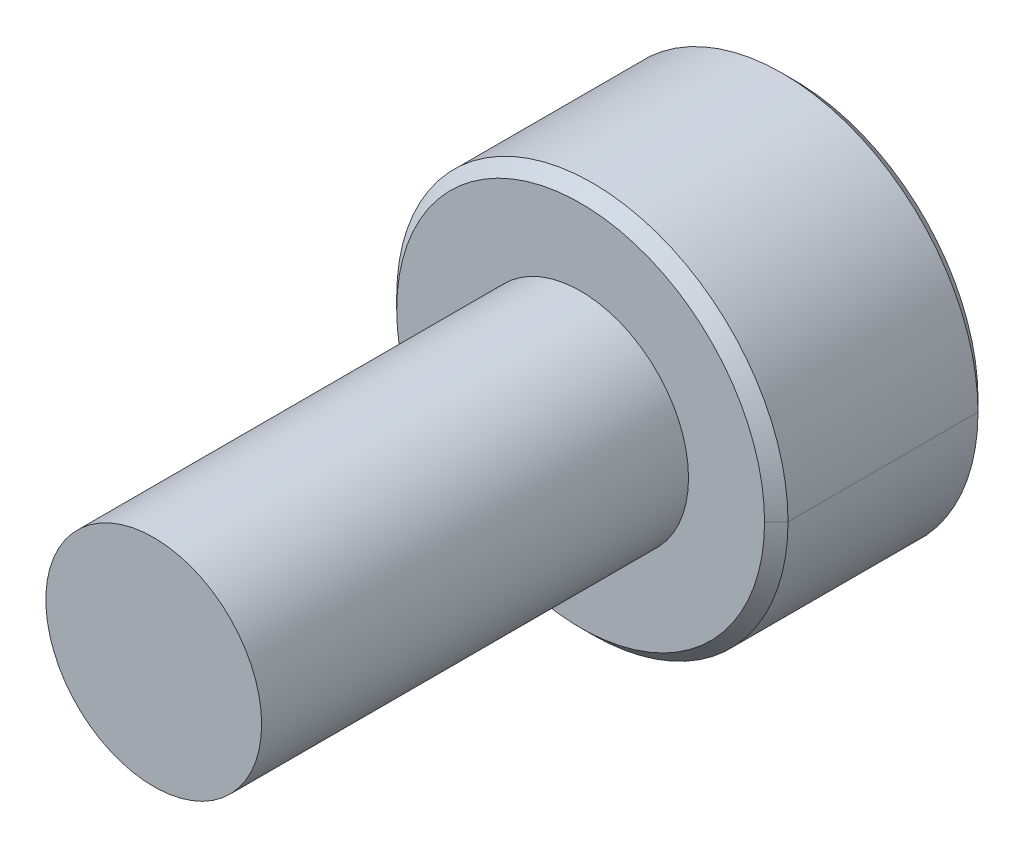
ISO-10303-21;
HEADER;
FILE_DESCRIPTION(('STEP AP214'),'2;1');
FILE_NAME('part.step','',(''),(''),'','','');
FILE_SCHEMA(('AUTOMOTIVE_DESIGN { 1 0 10303 214 1 1 1 1 }'));
ENDSEC;
DATA;
#1=APPLICATION_CONTEXT('core data for automotive mechanical design processes');
#2=APPLICATION_PROTOCOL_DEFINITION('international standard','automotive_design',2000,#1);
#3=PRODUCT_CONTEXT('',#1,'mechanical');
#4=PRODUCT('Part','Part','',(#3));
#5=PRODUCT_RELATED_PRODUCT_CATEGORY('part','',(#4));
#6=PRODUCT_DEFINITION_FORMATION('','',#4);
#7=PRODUCT_DEFINITION_CONTEXT('part definition',#1,'design');
#8=PRODUCT_DEFINITION('design','',#6,#7);
#9=PRODUCT_DEFINITION_SHAPE('','',#8);
#10=(LENGTH_UNIT() NAMED_UNIT(*) SI_UNIT(.MILLI.,.METRE.));
#11=(NAMED_UNIT(*) PLANE_ANGLE_UNIT() SI_UNIT($,.RADIAN.));
#12=(NAMED_UNIT(*) SI_UNIT($,.STERADIAN.) SOLID_ANGLE_UNIT());
#13=UNCERTAINTY_MEASURE_WITH_UNIT(LENGTH_MEASURE(1.E-05),#10,'distance_accuracy_value','');
#14=(GEOMETRIC_REPRESENTATION_CONTEXT(3) GLOBAL_UNCERTAINTY_ASSIGNED_CONTEXT((#13)) GLOBAL_UNIT_ASSIGNED_CONTEXT((#10,
#11,#12)) REPRESENTATION_CONTEXT('',''));
#15=CARTESIAN_POINT('',(0.,0.,0.));
#16=DIRECTION('',(0.,0.,1.));
#17=DIRECTION('',(1.,0.,0.));
#18=AXIS2_PLACEMENT_3D('',#15,#16,#17);
#19=CARTESIAN_POINT('',(0.,0.,-6.165));
#20=DIRECTION('',(0.,0.,-1.));
#21=DIRECTION('',(-1.,0.,0.));
#22=AXIS2_PLACEMENT_3D('',#19,#20,#21);
#23=CONICAL_SURFACE('',#22,2.75,0.785398163397453);
#24=CARTESIAN_POINT('',(0.,0.,-6.));
#25=DIRECTION('',(0.,0.,1.));
#26=DIRECTION('',(-1.,0.,0.));
#27=AXIS2_PLACEMENT_3D('',#24,#25,#26);
#28=CIRCLE('',#27,2.585);
#29=CARTESIAN_POINT('',(2.585,0.,-6.));
#30=VERTEX_POINT('',#29);
#31=CARTESIAN_POINT('',(-2.585,0.,-6.));
#32=VERTEX_POINT('',#31);
#33=EDGE_CURVE('E71',#30,#32,#28,.T.);
#34=ORIENTED_EDGE('',*,*,#33,.F.);
#35=DIRECTION('',(0.707106781186551,0.,-0.707106781186544));
#36=VECTOR('',#35,1.);
#37=CARTESIAN_POINT('',(2.75,0.,-6.165));
#38=LINE('',#37,#36);
#39=CARTESIAN_POINT('',(2.75,0.,-6.165));
#40=VERTEX_POINT('',#39);
#41=EDGE_CURVE('E11',#30,#40,#38,.T.);
#42=ORIENTED_EDGE('',*,*,#41,.T.);
#43=CARTESIAN_POINT('',(0.,0.,-6.165));
#44=DIRECTION('',(0.,0.,-1.));
#45=DIRECTION('',(-1.,0.,0.));
#46=AXIS2_PLACEMENT_3D('',#43,#44,#45);
#47=CIRCLE('',#46,2.75);
#48=CARTESIAN_POINT('',(-2.75,0.,-6.165));
#49=VERTEX_POINT('',#48);
#50=EDGE_CURVE('E481',#49,#40,#47,.T.);
#51=ORIENTED_EDGE('',*,*,#50,.F.);
#52=DIRECTION('',(-0.707106781186551,0.,-0.707106781186544));
#53=VECTOR('',#52,1.);
#54=CARTESIAN_POINT('',(-2.75,0.,-6.165));
#55=LINE('',#54,#53);
#56=EDGE_CURVE('E493',#32,#49,#55,.T.);
#57=ORIENTED_EDGE('',*,*,#56,.F.);
#58=EDGE_LOOP('',(#34,#42,#51,#57));
#59=FACE_BOUND('',#58,.T.);
#60=ADVANCED_FACE('F45',(#59),#23,.T.);
#61=CARTESIAN_POINT('',(0.,0.,-9.));
#62=DIRECTION('',(0.,0.,1.));
#63=DIRECTION('',(1.,0.,0.));
#64=AXIS2_PLACEMENT_3D('',#61,#62,#63);
#65=CONICAL_SURFACE('',#64,2.585,0.785398163397446);
#66=CARTESIAN_POINT('',(0.,0.,-9.));
#67=DIRECTION('',(0.,0.,-1.));
#68=DIRECTION('',(-1.,0.,0.));
#69=AXIS2_PLACEMENT_3D('',#66,#67,#68);
#70=CIRCLE('',#69,2.585);
#71=CARTESIAN_POINT('',(-2.585,0.,-9.));
#72=VERTEX_POINT('',#71);
#73=CARTESIAN_POINT('',(2.585,0.,-9.));
#74=VERTEX_POINT('',#73);
#75=EDGE_CURVE('E404',#72,#74,#70,.T.);
#76=ORIENTED_EDGE('',*,*,#75,.F.);
#77=DIRECTION('',(-0.707106781186546,0.,0.707106781186549));
#78=VECTOR('',#77,1.);
#79=CARTESIAN_POINT('',(-2.585,0.,-9.));
#80=LINE('',#79,#78);
#81=CARTESIAN_POINT('',(-2.75,0.,-8.835));
#82=VERTEX_POINT('',#81);
#83=EDGE_CURVE('E58',#72,#82,#80,.T.);
#84=ORIENTED_EDGE('',*,*,#83,.T.);
#85=CARTESIAN_POINT('',(0.,0.,-8.835));
#86=DIRECTION('',(0.,0.,1.));
#87=DIRECTION('',(-1.,0.,0.));
#88=AXIS2_PLACEMENT_3D('',#85,#86,#87);
#89=CIRCLE('',#88,2.75);
#90=CARTESIAN_POINT('',(2.75,0.,-8.835));
#91=VERTEX_POINT('',#90);
#92=EDGE_CURVE('E473',#91,#82,#89,.T.);
#93=ORIENTED_EDGE('',*,*,#92,.F.);
#94=DIRECTION('',(0.707106781186546,0.,0.707106781186549));
#95=VECTOR('',#94,1.);
#96=CARTESIAN_POINT('',(2.585,0.,-9.));
#97=LINE('',#96,#95);
#98=EDGE_CURVE('E408',#74,#91,#97,.T.);
#99=ORIENTED_EDGE('',*,*,#98,.F.);
#100=EDGE_LOOP('',(#76,#84,#93,#99));
#101=FACE_BOUND('',#100,.T.);
#102=ADVANCED_FACE('F256',(#101),#65,.T.);
#103=CARTESIAN_POINT('',(0.,0.,-9.));
#104=DIRECTION('',(0.,0.,-1.));
#105=DIRECTION('',(-1.,0.,0.));
#106=AXIS2_PLACEMENT_3D('',#103,#104,#105);
#107=CONICAL_SURFACE('',#106,1.44337567297406,0.78539816339745);
#108=CARTESIAN_POINT('',(-1.25,0.,-8.80662432702593));
#109=CARTESIAN_POINT('',(-1.25,0.180896648900341,-8.80662432702593));
#110=CARTESIAN_POINT('',(-1.25,0.371633306232305,-8.8606992153283));
#111=CARTESIAN_POINT('',(-1.25,0.536655871568181,-8.90748401754058));
#112=CARTESIAN_POINT('',(-1.25,0.721687836487031,-9.));
#113=B_SPLINE_CURVE_WITH_KNOTS('',2,(#108,#109,#110,#111,#112),.UNSPECIFIED.,.F.,.F.,(3,2,3),
(0.,0.5,1.),.UNSPECIFIED.);
#114=CARTESIAN_POINT('',(-1.25,0.,-8.80662432702594));
#115=VERTEX_POINT('',#114);
#116=CARTESIAN_POINT('',(-1.25,0.721687836487032,-9.));
#117=VERTEX_POINT('',#116);
#118=EDGE_CURVE('E194',#115,#117,#113,.T.);
#119=ORIENTED_EDGE('',*,*,#118,.F.);
#120=DIRECTION('',(-0.707106781186549,0.,-0.707106781186546));
#121=VECTOR('',#120,1.);
#122=CARTESIAN_POINT('',(-1.44337567297406,0.,-9.));
#123=LINE('',#122,#121);
#124=CARTESIAN_POINT('',(-1.44337567297406,0.,-9.));
#125=VERTEX_POINT('',#124);
#126=EDGE_CURVE('E421',#115,#125,#123,.T.);
#127=ORIENTED_EDGE('',*,*,#126,.T.);
#128=CARTESIAN_POINT('',(0.,0.,-9.));
#129=DIRECTION('',(0.,0.,-1.));
#130=DIRECTION('',(-1.,0.,0.));
#131=AXIS2_PLACEMENT_3D('',#128,#129,#130);
#132=CIRCLE('',#131,1.44337567297406);
#133=EDGE_CURVE('E243',#125,#117,#132,.T.);
#134=ORIENTED_EDGE('',*,*,#133,.T.);
#135=EDGE_LOOP('',(#119,#127,#134));
#136=FACE_BOUND('',#135,.T.);
#137=ADVANCED_FACE('F245',(#136),#107,.F.);
#138=CARTESIAN_POINT('',(0.,0.,-9.));
#139=DIRECTION('',(0.,0.,1.));
#140=DIRECTION('',(1.,0.,0.));
#141=AXIS2_PLACEMENT_3D('',#138,#139,#140);
#142=CYLINDRICAL_SURFACE('',#141,2.75);
#143=ORIENTED_EDGE('',*,*,#92,.T.);
#144=DIRECTION('',(0.,0.,1.));
#145=VECTOR('',#144,1.);
#146=CARTESIAN_POINT('',(-2.75,0.,-9.));
#147=LINE('',#146,#145);
#148=EDGE_CURVE('E434',#82,#49,#147,.T.);
#149=ORIENTED_EDGE('',*,*,#148,.T.);
#150=ORIENTED_EDGE('',*,*,#50,.T.);
#151=DIRECTION('',(0.,0.,1.));
#152=VECTOR('',#151,1.);
#153=CARTESIAN_POINT('',(2.75,0.,-9.));
#154=LINE('',#153,#152);
#155=EDGE_CURVE('E430',#91,#40,#154,.T.);
#156=ORIENTED_EDGE('',*,*,#155,.F.);
#157=EDGE_LOOP('',(#143,#149,#150,#156));
#158=FACE_BOUND('',#157,.T.);
#159=ADVANCED_FACE('F255',(#158),#142,.T.);
#160=CARTESIAN_POINT('',(0.,0.,-9.));
#161=DIRECTION('',(0.,0.,1.));
#162=DIRECTION('',(1.,0.,0.));
#163=AXIS2_PLACEMENT_3D('',#160,#161,#162);
#164=CYLINDRICAL_SURFACE('',#163,2.75);
#165=ORIENTED_EDGE('',*,*,#148,.F.);
#166=CARTESIAN_POINT('',(0.,0.,-8.835));
#167=DIRECTION('',(0.,0.,1.));
#168=DIRECTION('',(-1.,0.,0.));
#169=AXIS2_PLACEMENT_3D('',#166,#167,#168);
#170=CIRCLE('',#169,2.75);
#171=EDGE_CURVE('E419',#82,#91,#170,.T.);
#172=ORIENTED_EDGE('',*,*,#171,.T.);
#173=ORIENTED_EDGE('',*,*,#155,.T.);
#174=CARTESIAN_POINT('',(0.,0.,-6.165));
#175=DIRECTION('',(0.,0.,-1.));
#176=DIRECTION('',(-1.,0.,0.));
#177=AXIS2_PLACEMENT_3D('',#174,#175,#176);
#178=CIRCLE('',#177,2.75);
#179=EDGE_CURVE('E425',#40,#49,#178,.T.);
#180=ORIENTED_EDGE('',*,*,#179,.T.);
#181=EDGE_LOOP('',(#165,#172,#173,#180));
#182=FACE_BOUND('',#181,.T.);
#183=ADVANCED_FACE('F386',(#182),#164,.T.);
#184=CARTESIAN_POINT('',(0.,0.,-9.));
#185=DIRECTION('',(0.,0.,-1.));
#186=DIRECTION('',(0.,-1.,0.));
#187=AXIS2_PLACEMENT_3D('',#184,#185,#186);
#188=PLANE('',#187);
#189=CARTESIAN_POINT('',(0.,0.,-9.));
#190=DIRECTION('',(0.,0.,-1.));
#191=DIRECTION('',(-1.,0.,0.));
#192=AXIS2_PLACEMENT_3D('',#189,#190,#191);
#193=CIRCLE('',#192,2.585);
#194=EDGE_CURVE('E413',#74,#72,#193,.T.);
#195=ORIENTED_EDGE('',*,*,#194,.T.);
#196=ORIENTED_EDGE('',*,*,#75,.T.);
#197=EDGE_LOOP('',(#195,#196));
#198=FACE_BOUND('',#197,.T.);
#199=CARTESIAN_POINT('',(0.,0.,-9.));
#200=DIRECTION('',(0.,0.,-1.));
#201=DIRECTION('',(-1.,0.,0.));
#202=AXIS2_PLACEMENT_3D('',#199,#200,#201);
#203=CIRCLE('',#202,1.44337567297406);
#204=CARTESIAN_POINT('',(0.,1.44337567297406,-9.));
#205=VERTEX_POINT('',#204);
#206=EDGE_CURVE('E318',#117,#205,#203,.T.);
#207=ORIENTED_EDGE('',*,*,#206,.F.);
#208=ORIENTED_EDGE('',*,*,#133,.F.);
#209=CARTESIAN_POINT('',(0.,0.,-9.));
#210=DIRECTION('',(0.,0.,-1.));
#211=DIRECTION('',(-1.,0.,0.));
#212=AXIS2_PLACEMENT_3D('',#209,#210,#211);
#213=CIRCLE('',#212,1.44337567297406);
#214=CARTESIAN_POINT('',(-1.25,-0.721687836487033,-9.));
#215=VERTEX_POINT('',#214);
#216=EDGE_CURVE('E282',#215,#125,#213,.T.);
#217=ORIENTED_EDGE('',*,*,#216,.F.);
#218=CARTESIAN_POINT('',(0.,0.,-9.));
#219=DIRECTION('',(0.,0.,-1.));
#220=DIRECTION('',(-1.,0.,0.));
#221=AXIS2_PLACEMENT_3D('',#218,#219,#220);
#222=CIRCLE('',#221,1.44337567297406);
#223=CARTESIAN_POINT('',(0.,-1.44337567297406,-9.));
#224=VERTEX_POINT('',#223);
#225=EDGE_CURVE('E272',#224,#215,#222,.T.);
#226=ORIENTED_EDGE('',*,*,#225,.F.);
#227=CARTESIAN_POINT('',(0.,0.,-9.));
#228=DIRECTION('',(0.,0.,-1.));
#229=DIRECTION('',(-1.,0.,0.));
#230=AXIS2_PLACEMENT_3D('',#227,#228,#229);
#231=CIRCLE('',#230,1.44337567297406);
#232=CARTESIAN_POINT('',(1.25,-0.721687836487033,-9.));
#233=VERTEX_POINT('',#232);
#234=EDGE_CURVE('E281',#233,#224,#231,.T.);
#235=ORIENTED_EDGE('',*,*,#234,.F.);
#236=CARTESIAN_POINT('',(0.,0.,-9.));
#237=DIRECTION('',(0.,0.,-1.));
#238=DIRECTION('',(-1.,0.,0.));
#239=AXIS2_PLACEMENT_3D('',#236,#237,#238);
#240=CIRCLE('',#239,1.44337567297406);
#241=CARTESIAN_POINT('',(1.25,0.721687836487033,-9.));
#242=VERTEX_POINT('',#241);
#243=EDGE_CURVE('E343',#242,#233,#240,.T.);
#244=ORIENTED_EDGE('',*,*,#243,.F.);
#245=CARTESIAN_POINT('',(0.,0.,-9.));
#246=DIRECTION('',(0.,0.,-1.));
#247=DIRECTION('',(-1.,0.,0.));
#248=AXIS2_PLACEMENT_3D('',#245,#246,#247);
#249=CIRCLE('',#248,1.44337567297406);
#250=EDGE_CURVE('E339',#205,#242,#249,.T.);
#251=ORIENTED_EDGE('',*,*,#250,.F.);
#252=EDGE_LOOP('',(#207,#208,#217,#226,#235,#244,#251));
#253=FACE_BOUND('',#252,.T.);
#254=ADVANCED_FACE('F391',(#198,#253),#188,.T.);
#255=CARTESIAN_POINT('',(0.,0.,-6.));
#256=DIRECTION('',(0.,0.,-1.));
#257=DIRECTION('',(0.,-1.,0.));
#258=AXIS2_PLACEMENT_3D('',#255,#256,#257);
#259=PLANE('',#258);
#260=CARTESIAN_POINT('',(0.,0.,-6.));
#261=DIRECTION('',(0.,0.,-1.));
#262=DIRECTION('',(-1.,0.,0.));
#263=AXIS2_PLACEMENT_3D('',#260,#261,#262);
#264=CIRCLE('',#263,1.51645395010895);
#265=CARTESIAN_POINT('',(-1.51645395010895,0.,-6.));
#266=VERTEX_POINT('',#265);
#267=EDGE_CURVE('E512',#266,#266,#264,.F.);
#268=ORIENTED_EDGE('',*,*,#267,.F.);
#269=EDGE_LOOP('',(#268));
#270=FACE_BOUND('',#269,.T.);
#271=CARTESIAN_POINT('',(0.,0.,-6.));
#272=DIRECTION('',(0.,0.,1.));
#273=DIRECTION('',(-1.,0.,0.));
#274=AXIS2_PLACEMENT_3D('',#271,#272,#273);
#275=CIRCLE('',#274,2.585);
#276=EDGE_CURVE('E414',#32,#30,#275,.T.);
#277=ORIENTED_EDGE('',*,*,#276,.T.);
#278=ORIENTED_EDGE('',*,*,#33,.T.);
#279=EDGE_LOOP('',(#277,#278));
#280=FACE_BOUND('',#279,.T.);
#281=ADVANCED_FACE('F518',(#270,#280),#259,.F.);
#282=CARTESIAN_POINT('',(0.,0.,-9.));
#283=DIRECTION('',(0.,0.,-1.));
#284=DIRECTION('',(-1.,0.,0.));
#285=AXIS2_PLACEMENT_3D('',#282,#283,#284);
#286=CONICAL_SURFACE('',#285,1.44337567297406,0.78539816339745);
#287=ORIENTED_EDGE('',*,*,#250,.T.);
#288=CARTESIAN_POINT('',(0.,1.44337567297406,-9.));
#289=CARTESIAN_POINT('',(0.33343931272324,1.2508643960149,-8.80748872304083));
#290=CARTESIAN_POINT('',(0.622697264378245,1.08386123976164,-8.80662715507142));
#291=CARTESIAN_POINT('',(0.91356780893043,0.915927052565104,-8.8057607839207));
#292=CARTESIAN_POINT('',(1.25,0.721687836487032,-9.));
#293=B_SPLINE_CURVE_WITH_KNOTS('',2,(#288,#289,#290,#291,#292),.UNSPECIFIED.,.F.,.F.,(3,2,3),
(0.,0.5,1.),.UNSPECIFIED.);
#294=EDGE_CURVE('E349',#205,#242,#293,.T.);
#295=ORIENTED_EDGE('',*,*,#294,.F.);
#296=EDGE_LOOP('',(#287,#295));
#297=FACE_BOUND('',#296,.T.);
#298=ADVANCED_FACE('F521',(#297),#286,.F.);
#299=CARTESIAN_POINT('',(0.,0.,-9.));
#300=DIRECTION('',(0.,0.,-1.));
#301=DIRECTION('',(-1.,0.,0.));
#302=AXIS2_PLACEMENT_3D('',#299,#300,#301);
#303=CONICAL_SURFACE('',#302,1.44337567297406,0.78539816339745);
#304=ORIENTED_EDGE('',*,*,#243,.T.);
#305=CARTESIAN_POINT('',(1.25,0.721687836487033,-9.));
#306=CARTESIAN_POINT('',(1.25,0.538092414489122,-8.90820228900105));
#307=CARTESIAN_POINT('',(1.25,0.371670740916257,-8.86070988390206));
#308=CARTESIAN_POINT('',(1.25,0.182469151639214,-8.8067166849971));
#309=CARTESIAN_POINT('',(1.25,7.86844095029566E-05,-8.80662432950243));
#310=CARTESIAN_POINT('',(1.25,-0.1812567100001,-8.80653250825594));
#311=CARTESIAN_POINT('',(1.25,-0.371515987727131,-8.86066578692546));
#312=CARTESIAN_POINT('',(1.25,-0.537435467853739,-8.90787381568336));
#313=CARTESIAN_POINT('',(1.25,-0.721687836487031,-9.));
#314=B_SPLINE_CURVE_WITH_KNOTS('',2,(#305,#306,#307,#308,#309,#310,#311,#312,#313),
.UNSPECIFIED.,.F.,.F.,(3,2,2,2,3),(0.,0.25,0.5,0.75,1.),.UNSPECIFIED.);
#315=EDGE_CURVE('E361',#242,#233,#314,.T.);
#316=ORIENTED_EDGE('',*,*,#315,.F.);
#317=EDGE_LOOP('',(#304,#316));
#318=FACE_BOUND('',#317,.T.);
#319=ADVANCED_FACE('F263',(#318),#303,.F.);
#320=CARTESIAN_POINT('',(0.,0.,-9.));
#321=DIRECTION('',(0.,0.,-1.));
#322=DIRECTION('',(-1.,0.,0.));
#323=AXIS2_PLACEMENT_3D('',#320,#321,#322);
#324=CONICAL_SURFACE('',#323,1.44337567297406,0.78539816339745);
#325=ORIENTED_EDGE('',*,*,#234,.T.);
#326=CARTESIAN_POINT('',(1.25,-0.721687836487033,-9.));
#327=CARTESIAN_POINT('',(0.916560687278648,-0.91419911344511,-8.80748872304191));
#328=CARTESIAN_POINT('',(0.627302735621754,-1.08120226969946,-8.80662715507142));
#329=CARTESIAN_POINT('',(0.336432191071441,-1.24913645689491,-8.80576078391962));
#330=CARTESIAN_POINT('',(0.,-1.44337567297406,-9.));
#331=B_SPLINE_CURVE_WITH_KNOTS('',2,(#326,#327,#328,#329,#330),.UNSPECIFIED.,.F.,.F.,(3,2,3),
(0.,0.5,1.),.UNSPECIFIED.);
#332=EDGE_CURVE('E287',#233,#224,#331,.T.);
#333=ORIENTED_EDGE('',*,*,#332,.F.);
#334=EDGE_LOOP('',(#325,#333));
#335=FACE_BOUND('',#334,.T.);
#336=ADVANCED_FACE('F258',(#335),#324,.F.);
#337=CARTESIAN_POINT('',(0.,0.,-9.));
#338=DIRECTION('',(0.,0.,-1.));
#339=DIRECTION('',(-1.,0.,0.));
#340=AXIS2_PLACEMENT_3D('',#337,#338,#339);
#341=CONICAL_SURFACE('',#340,1.44337567297406,0.78539816339745);
#342=ORIENTED_EDGE('',*,*,#225,.T.);
#343=CARTESIAN_POINT('',(0.,-1.44337567297406,-9.));
#344=CARTESIAN_POINT('',(-0.333439312720416,-1.25086439601653,-8.80748872304245));
#345=CARTESIAN_POINT('',(-0.622697264378245,-1.08386123976164,-8.80662715507142));
#346=CARTESIAN_POINT('',(-0.913567808927632,-0.915927052566719,-8.80576078391908));
#347=CARTESIAN_POINT('',(-1.25,-0.721687836487032,-9.));
#348=B_SPLINE_CURVE_WITH_KNOTS('',2,(#343,#344,#345,#346,#347),.UNSPECIFIED.,.F.,.F.,(3,2,3),
(0.,0.5,1.),.UNSPECIFIED.);
#349=EDGE_CURVE('E184',#224,#215,#348,.T.);
#350=ORIENTED_EDGE('',*,*,#349,.F.);
#351=EDGE_LOOP('',(#342,#350));
#352=FACE_BOUND('',#351,.T.);
#353=ADVANCED_FACE('F262',(#352),#341,.F.);
#354=CARTESIAN_POINT('',(0.,0.,-9.));
#355=DIRECTION('',(0.,0.,-1.));
#356=DIRECTION('',(-1.,0.,0.));
#357=AXIS2_PLACEMENT_3D('',#354,#355,#356);
#358=CONICAL_SURFACE('',#357,1.44337567297406,0.78539816339745);
#359=ORIENTED_EDGE('',*,*,#126,.F.);
#360=CARTESIAN_POINT('',(-1.25,-0.721687836487033,-9.));
#361=CARTESIAN_POINT('',(-1.25,-0.538882168791653,-8.90859716615231));
#362=CARTESIAN_POINT('',(-1.25,-0.371553327845961,-8.86067642546119));
#363=CARTESIAN_POINT('',(-1.25,-0.182815114466653,-8.80662432702593));
#364=CARTESIAN_POINT('',(-1.25,0.,-8.80662432702593));
#365=B_SPLINE_CURVE_WITH_KNOTS('',2,(#360,#361,#362,#363,#364),.UNSPECIFIED.,.F.,.F.,(3,2,3),
(0.,0.5,1.),.UNSPECIFIED.);
#366=EDGE_CURVE('E188',#215,#115,#365,.T.);
#367=ORIENTED_EDGE('',*,*,#366,.F.);
#368=ORIENTED_EDGE('',*,*,#216,.T.);
#369=EDGE_LOOP('',(#359,#367,#368));
#370=FACE_BOUND('',#369,.T.);
#371=ADVANCED_FACE('F307',(#370),#358,.F.);
#372=CARTESIAN_POINT('',(0.,0.,-9.));
#373=DIRECTION('',(0.,0.,-1.));
#374=DIRECTION('',(-1.,0.,0.));
#375=AXIS2_PLACEMENT_3D('',#372,#373,#374);
#376=CONICAL_SURFACE('',#375,1.44337567297406,0.78539816339745);
#377=ORIENTED_EDGE('',*,*,#206,.T.);
#378=CARTESIAN_POINT('',(-1.25,0.721687836487033,-9.));
#379=CARTESIAN_POINT('',(-0.916560687279589,0.914199113444566,-8.80748872304245));
#380=CARTESIAN_POINT('',(-0.627302735621754,1.08120226969946,-8.80662715507142));
#381=CARTESIAN_POINT('',(-0.336432191072373,1.24913645689438,-8.80576078391908));
#382=CARTESIAN_POINT('',(0.,1.44337567297407,-9.));
#383=B_SPLINE_CURVE_WITH_KNOTS('',2,(#378,#379,#380,#381,#382),.UNSPECIFIED.,.F.,.F.,(3,2,3),
(0.,0.5,1.),.UNSPECIFIED.);
#384=EDGE_CURVE('E492',#117,#205,#383,.T.);
#385=ORIENTED_EDGE('',*,*,#384,.F.);
#386=EDGE_LOOP('',(#377,#385));
#387=FACE_BOUND('',#386,.T.);
#388=ADVANCED_FACE('F384',(#387),#376,.F.);
#389=CARTESIAN_POINT('',(1.25,2.1650635094611,-7.125));
#390=DIRECTION('',(0.,0.,-1.));
#391=DIRECTION('',(0.,-1.,0.));
#392=AXIS2_PLACEMENT_3D('',#389,#390,#391);
#393=PLANE('',#392);
#394=DIRECTION('',(0.866025403784439,0.5,0.));
#395=VECTOR('',#394,1.);
#396=CARTESIAN_POINT('',(-1.25,0.721687836487033,-7.125));
#397=LINE('',#396,#395);
#398=CARTESIAN_POINT('',(-1.25,0.721687836487033,-7.125));
#399=VERTEX_POINT('',#398);
#400=CARTESIAN_POINT('',(0.,1.44337567297406,-7.125));
#401=VERTEX_POINT('',#400);
#402=EDGE_CURVE('E323',#399,#401,#397,.T.);
#403=ORIENTED_EDGE('',*,*,#402,.T.);
#404=DIRECTION('',(0.866025403784439,-0.5,0.));
#405=VECTOR('',#404,1.);
#406=CARTESIAN_POINT('',(0.,1.44337567297406,-7.125));
#407=LINE('',#406,#405);
#408=CARTESIAN_POINT('',(1.25,0.721687836487033,-7.125));
#409=VERTEX_POINT('',#408);
#410=EDGE_CURVE('E330',#401,#409,#407,.T.);
#411=ORIENTED_EDGE('',*,*,#410,.T.);
#412=DIRECTION('',(0.,-1.,0.));
#413=VECTOR('',#412,1.);
#414=CARTESIAN_POINT('',(1.25,0.721687836487033,-7.125));
#415=LINE('',#414,#413);
#416=CARTESIAN_POINT('',(1.25,-0.721687836487033,-7.125));
#417=VERTEX_POINT('',#416);
#418=EDGE_CURVE('E437',#409,#417,#415,.T.);
#419=ORIENTED_EDGE('',*,*,#418,.T.);
#420=DIRECTION('',(-0.866025403784439,-0.5,0.));
#421=VECTOR('',#420,1.);
#422=CARTESIAN_POINT('',(1.25,-0.721687836487033,-7.125));
#423=LINE('',#422,#421);
#424=CARTESIAN_POINT('',(0.,-1.44337567297406,-7.125));
#425=VERTEX_POINT('',#424);
#426=EDGE_CURVE('E178',#417,#425,#423,.T.);
#427=ORIENTED_EDGE('',*,*,#426,.T.);
#428=DIRECTION('',(-0.866025403784439,0.5,0.));
#429=VECTOR('',#428,1.);
#430=CARTESIAN_POINT('',(0.,-1.44337567297406,-7.125));
#431=LINE('',#430,#429);
#432=CARTESIAN_POINT('',(-1.25,-0.721687836487033,-7.125));
#433=VERTEX_POINT('',#432);
#434=EDGE_CURVE('E154',#425,#433,#431,.T.);
#435=ORIENTED_EDGE('',*,*,#434,.T.);
#436=DIRECTION('',(0.,1.,0.));
#437=VECTOR('',#436,1.);
#438=CARTESIAN_POINT('',(-1.25,-0.721687836487033,-7.125));
#439=LINE('',#438,#437);
#440=EDGE_CURVE('E163',#433,#399,#439,.T.);
#441=ORIENTED_EDGE('',*,*,#440,.T.);
#442=EDGE_LOOP('',(#403,#411,#419,#427,#435,#441));
#443=FACE_BOUND('',#442,.T.);
#444=ADVANCED_FACE('F176',(#443),#393,.T.);
#445=CARTESIAN_POINT('',(0.,1.44337567297406,-7.125));
#446=DIRECTION('',(0.5,0.866025403784439,0.));
#447=DIRECTION('',(0.,0.,-1.));
#448=AXIS2_PLACEMENT_3D('',#445,#446,#447);
#449=PLANE('',#448);
#450=DIRECTION('',(0.,0.,-1.));
#451=VECTOR('',#450,1.);
#452=CARTESIAN_POINT('',(0.,1.44337567297406,-7.125));
#453=LINE('',#452,#451);
#454=EDGE_CURVE('E174',#401,#205,#453,.T.);
#455=ORIENTED_EDGE('',*,*,#454,.T.);
#456=ORIENTED_EDGE('',*,*,#294,.T.);
#457=DIRECTION('',(0.,0.,-1.));
#458=VECTOR('',#457,1.);
#459=CARTESIAN_POINT('',(1.25,0.721687836487033,-7.125));
#460=LINE('',#459,#458);
#461=EDGE_CURVE('E357',#409,#242,#460,.T.);
#462=ORIENTED_EDGE('',*,*,#461,.F.);
#463=ORIENTED_EDGE('',*,*,#410,.F.);
#464=EDGE_LOOP('',(#455,#456,#462,#463));
#465=FACE_BOUND('',#464,.T.);
#466=ADVANCED_FACE('F382',(#465),#449,.F.);
#467=CARTESIAN_POINT('',(1.25,0.721687836487033,-7.125));
#468=DIRECTION('',(1.,0.,0.));
#469=DIRECTION('',(0.,1.,0.));
#470=AXIS2_PLACEMENT_3D('',#467,#468,#469);
#471=PLANE('',#470);
#472=ORIENTED_EDGE('',*,*,#461,.T.);
#473=ORIENTED_EDGE('',*,*,#315,.T.);
#474=DIRECTION('',(0.,0.,-1.));
#475=VECTOR('',#474,1.);
#476=CARTESIAN_POINT('',(1.25,-0.721687836487033,-7.125));
#477=LINE('',#476,#475);
#478=EDGE_CURVE('E553',#417,#233,#477,.T.);
#479=ORIENTED_EDGE('',*,*,#478,.F.);
#480=ORIENTED_EDGE('',*,*,#418,.F.);
#481=EDGE_LOOP('',(#472,#473,#479,#480));
#482=FACE_BOUND('',#481,.T.);
#483=ADVANCED_FACE('F373',(#482),#471,.F.);
#484=CARTESIAN_POINT('',(1.25,-0.721687836487033,-7.125));
#485=DIRECTION('',(0.5,-0.866025403784439,0.));
#486=DIRECTION('',(0.,0.,-1.));
#487=AXIS2_PLACEMENT_3D('',#484,#485,#486);
#488=PLANE('',#487);
#489=ORIENTED_EDGE('',*,*,#478,.T.);
#490=ORIENTED_EDGE('',*,*,#332,.T.);
#491=DIRECTION('',(0.,0.,-1.));
#492=VECTOR('',#491,1.);
#493=CARTESIAN_POINT('',(0.,-1.44337567297406,-7.125));
#494=LINE('',#493,#492);
#495=EDGE_CURVE('E193',#425,#224,#494,.T.);
#496=ORIENTED_EDGE('',*,*,#495,.F.);
#497=ORIENTED_EDGE('',*,*,#426,.F.);
#498=EDGE_LOOP('',(#489,#490,#496,#497));
#499=FACE_BOUND('',#498,.T.);
#500=ADVANCED_FACE('F217',(#499),#488,.F.);
#501=CARTESIAN_POINT('',(0.,-1.44337567297406,-7.125));
#502=DIRECTION('',(-0.5,-0.866025403784439,0.));
#503=DIRECTION('',(-0.866025403784439,0.5,0.));
#504=AXIS2_PLACEMENT_3D('',#501,#502,#503);
#505=PLANE('',#504);
#506=ORIENTED_EDGE('',*,*,#495,.T.);
#507=ORIENTED_EDGE('',*,*,#349,.T.);
#508=DIRECTION('',(0.,0.,-1.));
#509=VECTOR('',#508,1.);
#510=CARTESIAN_POINT('',(-1.25,-0.721687836487033,-7.125));
#511=LINE('',#510,#509);
#512=EDGE_CURVE('E166',#433,#215,#511,.T.);
#513=ORIENTED_EDGE('',*,*,#512,.F.);
#514=ORIENTED_EDGE('',*,*,#434,.F.);
#515=EDGE_LOOP('',(#506,#507,#513,#514));
#516=FACE_BOUND('',#515,.T.);
#517=ADVANCED_FACE('F183',(#516),#505,.F.);
#518=CARTESIAN_POINT('',(-1.25,-0.721687836487033,-7.125));
#519=DIRECTION('',(-1.,0.,0.));
#520=DIRECTION('',(0.,0.,1.));
#521=AXIS2_PLACEMENT_3D('',#518,#519,#520);
#522=PLANE('',#521);
#523=ORIENTED_EDGE('',*,*,#512,.T.);
#524=ORIENTED_EDGE('',*,*,#366,.T.);
#525=ORIENTED_EDGE('',*,*,#118,.T.);
#526=DIRECTION('',(0.,0.,-1.));
#527=VECTOR('',#526,1.);
#528=CARTESIAN_POINT('',(-1.25,0.721687836487033,-7.125));
#529=LINE('',#528,#527);
#530=EDGE_CURVE('E169',#399,#117,#529,.T.);
#531=ORIENTED_EDGE('',*,*,#530,.F.);
#532=ORIENTED_EDGE('',*,*,#440,.F.);
#533=EDGE_LOOP('',(#523,#524,#525,#531,#532));
#534=FACE_BOUND('',#533,.T.);
#535=ADVANCED_FACE('F164',(#534),#522,.F.);
#536=CARTESIAN_POINT('',(-1.25,0.721687836487033,-7.125));
#537=DIRECTION('',(-0.5,0.866025403784439,0.));
#538=DIRECTION('',(0.,0.,1.));
#539=AXIS2_PLACEMENT_3D('',#536,#537,#538);
#540=PLANE('',#539);
#541=ORIENTED_EDGE('',*,*,#530,.T.);
#542=ORIENTED_EDGE('',*,*,#384,.T.);
#543=ORIENTED_EDGE('',*,*,#454,.F.);
#544=ORIENTED_EDGE('',*,*,#402,.F.);
#545=EDGE_LOOP('',(#541,#542,#543,#544));
#546=FACE_BOUND('',#545,.T.);
#547=ADVANCED_FACE('F216',(#546),#540,.F.);
#548=CARTESIAN_POINT('',(0.,0.,-9.));
#549=DIRECTION('',(0.,0.,1.));
#550=DIRECTION('',(1.,0.,0.));
#551=AXIS2_PLACEMENT_3D('',#548,#549,#550);
#552=CONICAL_SURFACE('',#551,2.585,0.785398163397446);
#553=ORIENTED_EDGE('',*,*,#83,.F.);
#554=ORIENTED_EDGE('',*,*,#194,.F.);
#555=ORIENTED_EDGE('',*,*,#98,.T.);
#556=ORIENTED_EDGE('',*,*,#171,.F.);
#557=EDGE_LOOP('',(#553,#554,#555,#556));
#558=FACE_BOUND('',#557,.T.);
#559=ADVANCED_FACE('F417',(#558),#552,.T.);
#560=CARTESIAN_POINT('',(0.,0.,-6.165));
#561=DIRECTION('',(0.,0.,-1.));
#562=DIRECTION('',(-1.,0.,0.));
#563=AXIS2_PLACEMENT_3D('',#560,#561,#562);
#564=CONICAL_SURFACE('',#563,2.75,0.785398163397453);
#565=ORIENTED_EDGE('',*,*,#41,.F.);
#566=ORIENTED_EDGE('',*,*,#276,.F.);
#567=ORIENTED_EDGE('',*,*,#56,.T.);
#568=ORIENTED_EDGE('',*,*,#179,.F.);
#569=EDGE_LOOP('',(#565,#566,#567,#568));
#570=FACE_BOUND('',#569,.T.);
#571=ADVANCED_FACE('F47',(#570),#564,.T.);
#572=CARTESIAN_POINT('',(0.,0.,-9.002));
#573=DIRECTION('',(0.,0.,1.));
#574=DIRECTION('',(1.,0.,0.));
#575=AXIS2_PLACEMENT_3D('',#572,#573,#574);
#576=CYLINDRICAL_SURFACE('',#575,1.51645395010895);
#577=CARTESIAN_POINT('',(0.,0.,0.));
#578=DIRECTION('',(0.,0.,1.));
#579=DIRECTION('',(1.,0.,0.));
#580=AXIS2_PLACEMENT_3D('',#577,#578,#579);
#581=CIRCLE('',#580,1.51645395010895);
#582=CARTESIAN_POINT('',(1.51645395010895,0.,0.));
#583=VERTEX_POINT('',#582);
#584=EDGE_CURVE('E506',#583,#583,#581,.T.);
#585=ORIENTED_EDGE('',*,*,#584,.F.);
#586=EDGE_LOOP('',(#585));
#587=FACE_BOUND('',#586,.T.);
#588=ORIENTED_EDGE('',*,*,#267,.T.);
#589=EDGE_LOOP('',(#588));
#590=FACE_BOUND('',#589,.T.);
#591=ADVANCED_FACE('F456',(#587,#590),#576,.T.);
#592=CARTESIAN_POINT('',(0.,0.,0.));
#593=DIRECTION('',(0.,0.,1.));
#594=DIRECTION('',(1.,0.,0.));
#595=AXIS2_PLACEMENT_3D('',#592,#593,#594);
#596=PLANE('',#595);
#597=ORIENTED_EDGE('',*,*,#584,.T.);
#598=EDGE_LOOP('',(#597));
#599=FACE_BOUND('',#598,.T.);
#600=ADVANCED_FACE('F726',(#599),#596,.T.);
#601=CLOSED_SHELL('',(#60,#102,#137,#159,#183,#254,#281,#298,#319,#336,#353,#371,#388,#444,#466,
#483,#500,#517,#535,#547,#559,#571,#591,#600));
#602=MANIFOLD_SOLID_BREP('B2',#601);
#603=ADVANCED_BREP_SHAPE_REPRESENTATION('',(#18,#602),#14);
#604=SHAPE_DEFINITION_REPRESENTATION(#9,#603);
ENDSEC;
END-ISO-10303-21;
